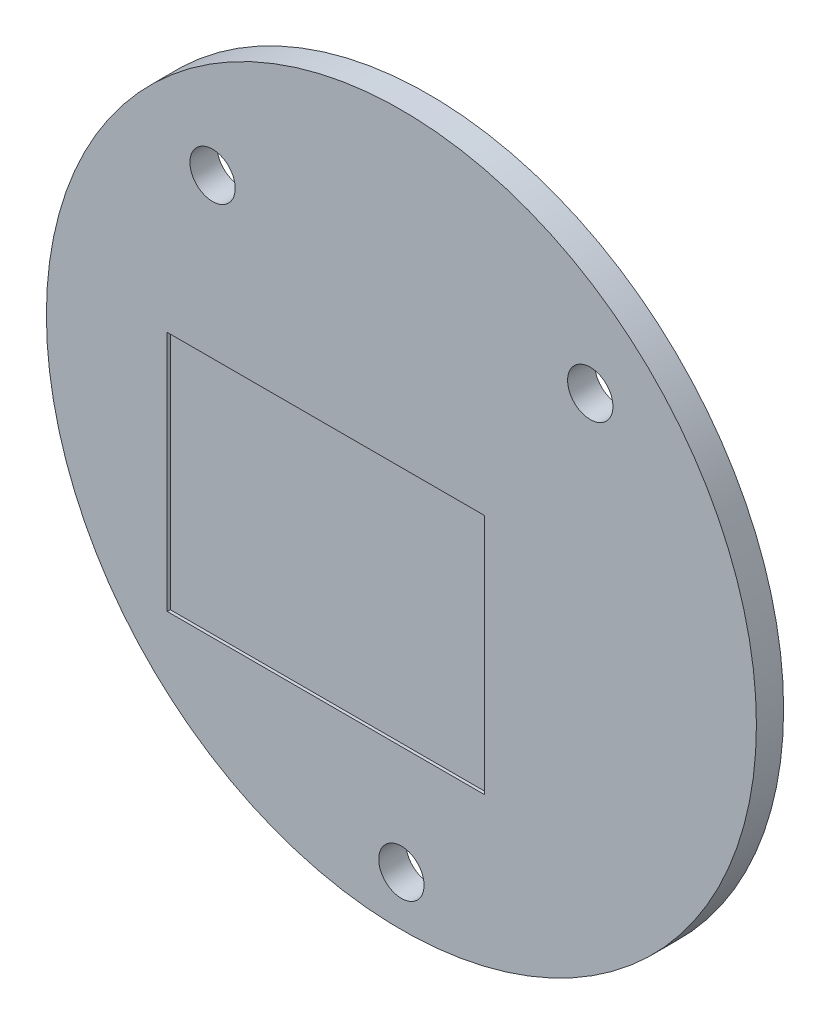
ISO-10303-21;
HEADER;
FILE_DESCRIPTION(('STEP AP214'),'2;1');
FILE_NAME('part.step','',(''),(''),'','','');
FILE_SCHEMA(('AUTOMOTIVE_DESIGN { 1 0 10303 214 1 1 1 1 }'));
ENDSEC;
DATA;
#1=APPLICATION_CONTEXT('core data for automotive mechanical design processes');
#2=APPLICATION_PROTOCOL_DEFINITION('international standard','automotive_design',2000,#1);
#3=PRODUCT_CONTEXT('',#1,'mechanical');
#4=PRODUCT('Part','Part','',(#3));
#5=PRODUCT_RELATED_PRODUCT_CATEGORY('part','',(#4));
#6=PRODUCT_DEFINITION_FORMATION('','',#4);
#7=PRODUCT_DEFINITION_CONTEXT('part definition',#1,'design');
#8=PRODUCT_DEFINITION('design','',#6,#7);
#9=PRODUCT_DEFINITION_SHAPE('','',#8);
#10=(LENGTH_UNIT() NAMED_UNIT(*) SI_UNIT(.MILLI.,.METRE.));
#11=(NAMED_UNIT(*) PLANE_ANGLE_UNIT() SI_UNIT($,.RADIAN.));
#12=(NAMED_UNIT(*) SI_UNIT($,.STERADIAN.) SOLID_ANGLE_UNIT());
#13=UNCERTAINTY_MEASURE_WITH_UNIT(LENGTH_MEASURE(1.E-05),#10,'distance_accuracy_value','');
#14=(GEOMETRIC_REPRESENTATION_CONTEXT(3) GLOBAL_UNCERTAINTY_ASSIGNED_CONTEXT((#13)) GLOBAL_UNIT_ASSIGNED_CONTEXT((#10,
#11,#12)) REPRESENTATION_CONTEXT('',''));
#15=CARTESIAN_POINT('',(0.,0.,0.));
#16=DIRECTION('',(0.,0.,1.));
#17=DIRECTION('',(1.,0.,0.));
#18=AXIS2_PLACEMENT_3D('',#15,#16,#17);
#19=CARTESIAN_POINT('',(0.,0.,1.8));
#20=DIRECTION('',(0.,0.,1.));
#21=DIRECTION('',(1.,0.,0.));
#22=AXIS2_PLACEMENT_3D('',#19,#20,#21);
#23=PLANE('',#22);
#24=DIRECTION('',(0.,-1.,0.));
#25=VECTOR('',#24,1.);
#26=CARTESIAN_POINT('',(-15.4999999999998,-13.0000000000009,1.8));
#27=LINE('',#26,#25);
#28=CARTESIAN_POINT('',(-15.4999999999999,2.99999999999993,1.8));
#29=VERTEX_POINT('',#28);
#30=CARTESIAN_POINT('',(-15.4999999999998,-13.0000000000009,1.8));
#31=VERTEX_POINT('',#30);
#32=EDGE_CURVE('E47',#29,#31,#27,.T.);
#33=ORIENTED_EDGE('',*,*,#32,.F.);
#34=DIRECTION('',(-1.,0.,0.));
#35=VECTOR('',#34,1.);
#36=CARTESIAN_POINT('',(-15.4999999999999,2.99999999999993,1.8));
#37=LINE('',#36,#35);
#38=CARTESIAN_POINT('',(5.49999999999998,3.00000000000003,1.8));
#39=VERTEX_POINT('',#38);
#40=EDGE_CURVE('E98',#39,#29,#37,.T.);
#41=ORIENTED_EDGE('',*,*,#40,.F.);
#42=DIRECTION('',(0.,1.,0.));
#43=VECTOR('',#42,1.);
#44=CARTESIAN_POINT('',(5.50000000000019,-13.0000000000008,1.8));
#45=LINE('',#44,#43);
#46=CARTESIAN_POINT('',(5.50000000000019,-13.0000000000008,1.8));
#47=VERTEX_POINT('',#46);
#48=EDGE_CURVE('E104',#47,#39,#45,.T.);
#49=ORIENTED_EDGE('',*,*,#48,.F.);
#50=DIRECTION('',(1.,0.,0.));
#51=VECTOR('',#50,1.);
#52=CARTESIAN_POINT('',(-15.4999999999998,-13.0000000000009,1.8));
#53=LINE('',#52,#51);
#54=EDGE_CURVE('E82',#31,#47,#53,.T.);
#55=ORIENTED_EDGE('',*,*,#54,.F.);
#56=EDGE_LOOP('',(#33,#41,#49,#55));
#57=FACE_BOUND('',#56,.T.);
#58=CARTESIAN_POINT('',(-12.5,13.5,1.8));
#59=DIRECTION('',(0.,0.,1.));
#60=DIRECTION('',(1.,0.,0.));
#61=AXIS2_PLACEMENT_3D('',#58,#59,#60);
#62=CIRCLE('',#61,1.5);
#63=CARTESIAN_POINT('',(-11.,13.5,1.8));
#64=VERTEX_POINT('',#63);
#65=EDGE_CURVE('E117',#64,#64,#62,.T.);
#66=ORIENTED_EDGE('',*,*,#65,.F.);
#67=EDGE_LOOP('',(#66));
#68=FACE_BOUND('',#67,.T.);
#69=CARTESIAN_POINT('',(0.,0.,1.8));
#70=DIRECTION('',(0.,0.,1.));
#71=DIRECTION('',(1.,0.,0.));
#72=AXIS2_PLACEMENT_3D('',#69,#70,#71);
#73=CIRCLE('',#72,23.5);
#74=CARTESIAN_POINT('',(23.5,0.,1.8));
#75=VERTEX_POINT('',#74);
#76=EDGE_CURVE('E11',#75,#75,#73,.T.);
#77=ORIENTED_EDGE('',*,*,#76,.T.);
#78=EDGE_LOOP('',(#77));
#79=FACE_BOUND('',#78,.T.);
#80=CARTESIAN_POINT('',(0.,-20.2,1.8));
#81=DIRECTION('',(0.,0.,1.));
#82=DIRECTION('',(1.,0.,0.));
#83=AXIS2_PLACEMENT_3D('',#80,#81,#82);
#84=CIRCLE('',#83,1.5);
#85=CARTESIAN_POINT('',(1.5,-20.2,1.8));
#86=VERTEX_POINT('',#85);
#87=EDGE_CURVE('E123',#86,#86,#84,.T.);
#88=ORIENTED_EDGE('',*,*,#87,.F.);
#89=EDGE_LOOP('',(#88));
#90=FACE_BOUND('',#89,.T.);
#91=CARTESIAN_POINT('',(12.5,13.5,1.8));
#92=DIRECTION('',(0.,0.,1.));
#93=DIRECTION('',(1.,0.,0.));
#94=AXIS2_PLACEMENT_3D('',#91,#92,#93);
#95=CIRCLE('',#94,1.5);
#96=CARTESIAN_POINT('',(14.,13.5,1.8));
#97=VERTEX_POINT('',#96);
#98=EDGE_CURVE('E111',#97,#97,#95,.T.);
#99=ORIENTED_EDGE('',*,*,#98,.F.);
#100=EDGE_LOOP('',(#99));
#101=FACE_BOUND('',#100,.T.);
#102=ADVANCED_FACE('F32',(#57,#68,#79,#90,#101),#23,.T.);
#103=CARTESIAN_POINT('',(0.,0.,0.));
#104=DIRECTION('',(0.,0.,1.));
#105=DIRECTION('',(1.,0.,0.));
#106=AXIS2_PLACEMENT_3D('',#103,#104,#105);
#107=PLANE('',#106);
#108=CARTESIAN_POINT('',(0.,0.,0.));
#109=DIRECTION('',(0.,0.,1.));
#110=DIRECTION('',(1.,0.,0.));
#111=AXIS2_PLACEMENT_3D('',#108,#109,#110);
#112=CIRCLE('',#111,23.5);
#113=CARTESIAN_POINT('',(23.5,0.,0.));
#114=VERTEX_POINT('',#113);
#115=EDGE_CURVE('E36',#114,#114,#112,.T.);
#116=ORIENTED_EDGE('',*,*,#115,.F.);
#117=EDGE_LOOP('',(#116));
#118=FACE_BOUND('',#117,.T.);
#119=CARTESIAN_POINT('',(0.,-20.2,0.));
#120=DIRECTION('',(0.,0.,1.));
#121=DIRECTION('',(1.,0.,0.));
#122=AXIS2_PLACEMENT_3D('',#119,#120,#121);
#123=CIRCLE('',#122,1.5);
#124=CARTESIAN_POINT('',(1.5,-20.2,0.));
#125=VERTEX_POINT('',#124);
#126=EDGE_CURVE('E120',#125,#125,#123,.T.);
#127=ORIENTED_EDGE('',*,*,#126,.T.);
#128=EDGE_LOOP('',(#127));
#129=FACE_BOUND('',#128,.T.);
#130=CARTESIAN_POINT('',(-12.5,13.5,0.));
#131=DIRECTION('',(0.,0.,1.));
#132=DIRECTION('',(1.,0.,0.));
#133=AXIS2_PLACEMENT_3D('',#130,#131,#132);
#134=CIRCLE('',#133,1.5);
#135=CARTESIAN_POINT('',(-11.,13.5,0.));
#136=VERTEX_POINT('',#135);
#137=EDGE_CURVE('E114',#136,#136,#134,.T.);
#138=ORIENTED_EDGE('',*,*,#137,.T.);
#139=EDGE_LOOP('',(#138));
#140=FACE_BOUND('',#139,.T.);
#141=CARTESIAN_POINT('',(12.5,13.5,0.));
#142=DIRECTION('',(0.,0.,1.));
#143=DIRECTION('',(1.,0.,0.));
#144=AXIS2_PLACEMENT_3D('',#141,#142,#143);
#145=CIRCLE('',#144,1.5);
#146=CARTESIAN_POINT('',(14.,13.5,0.));
#147=VERTEX_POINT('',#146);
#148=EDGE_CURVE('E108',#147,#147,#145,.T.);
#149=ORIENTED_EDGE('',*,*,#148,.T.);
#150=EDGE_LOOP('',(#149));
#151=FACE_BOUND('',#150,.T.);
#152=ADVANCED_FACE('F129',(#118,#129,#140,#151),#107,.F.);
#153=CARTESIAN_POINT('',(0.,0.,1.8));
#154=DIRECTION('',(0.,0.,-1.));
#155=DIRECTION('',(-1.,0.,0.));
#156=AXIS2_PLACEMENT_3D('',#153,#154,#155);
#157=CYLINDRICAL_SURFACE('',#156,23.5);
#158=ORIENTED_EDGE('',*,*,#76,.F.);
#159=EDGE_LOOP('',(#158));
#160=FACE_BOUND('',#159,.T.);
#161=ORIENTED_EDGE('',*,*,#115,.T.);
#162=EDGE_LOOP('',(#161));
#163=FACE_BOUND('',#162,.T.);
#164=ADVANCED_FACE('F34',(#160,#163),#157,.T.);
#165=CARTESIAN_POINT('',(0.,-20.2,1.8));
#166=DIRECTION('',(0.,0.,-1.));
#167=DIRECTION('',(-1.,0.,0.));
#168=AXIS2_PLACEMENT_3D('',#165,#166,#167);
#169=CYLINDRICAL_SURFACE('',#168,1.5);
#170=ORIENTED_EDGE('',*,*,#87,.T.);
#171=EDGE_LOOP('',(#170));
#172=FACE_BOUND('',#171,.T.);
#173=ORIENTED_EDGE('',*,*,#126,.F.);
#174=EDGE_LOOP('',(#173));
#175=FACE_BOUND('',#174,.T.);
#176=ADVANCED_FACE('F132',(#172,#175),#169,.F.);
#177=CARTESIAN_POINT('',(-12.5,13.5,1.8));
#178=DIRECTION('',(0.,0.,-1.));
#179=DIRECTION('',(-1.,0.,0.));
#180=AXIS2_PLACEMENT_3D('',#177,#178,#179);
#181=CYLINDRICAL_SURFACE('',#180,1.5);
#182=ORIENTED_EDGE('',*,*,#65,.T.);
#183=EDGE_LOOP('',(#182));
#184=FACE_BOUND('',#183,.T.);
#185=ORIENTED_EDGE('',*,*,#137,.F.);
#186=EDGE_LOOP('',(#185));
#187=FACE_BOUND('',#186,.T.);
#188=ADVANCED_FACE('F134',(#184,#187),#181,.F.);
#189=CARTESIAN_POINT('',(12.5,13.5,1.8));
#190=DIRECTION('',(0.,0.,-1.));
#191=DIRECTION('',(-1.,0.,0.));
#192=AXIS2_PLACEMENT_3D('',#189,#190,#191);
#193=CYLINDRICAL_SURFACE('',#192,1.5);
#194=ORIENTED_EDGE('',*,*,#98,.T.);
#195=EDGE_LOOP('',(#194));
#196=FACE_BOUND('',#195,.T.);
#197=ORIENTED_EDGE('',*,*,#148,.F.);
#198=EDGE_LOOP('',(#197));
#199=FACE_BOUND('',#198,.T.);
#200=ADVANCED_FACE('F141',(#196,#199),#193,.F.);
#201=CARTESIAN_POINT('',(-15.4999999999998,-13.0000000000009,1.6));
#202=DIRECTION('',(-1.,0.,0.));
#203=DIRECTION('',(0.,-1.,0.));
#204=AXIS2_PLACEMENT_3D('',#201,#202,#203);
#205=PLANE('',#204);
#206=ORIENTED_EDGE('',*,*,#32,.T.);
#207=DIRECTION('',(0.,0.,1.));
#208=VECTOR('',#207,1.);
#209=CARTESIAN_POINT('',(-15.4999999999998,-13.0000000000009,1.6));
#210=LINE('',#209,#208);
#211=CARTESIAN_POINT('',(-15.4999999999998,-13.0000000000009,1.6));
#212=VERTEX_POINT('',#211);
#213=EDGE_CURVE('E70',#212,#31,#210,.T.);
#214=ORIENTED_EDGE('',*,*,#213,.F.);
#215=DIRECTION('',(0.,-1.,0.));
#216=VECTOR('',#215,1.);
#217=CARTESIAN_POINT('',(-15.4999999999998,-13.0000000000009,1.6));
#218=LINE('',#217,#216);
#219=CARTESIAN_POINT('',(-15.4999999999999,2.99999999999993,1.6));
#220=VERTEX_POINT('',#219);
#221=EDGE_CURVE('E96',#220,#212,#218,.T.);
#222=ORIENTED_EDGE('',*,*,#221,.F.);
#223=DIRECTION('',(0.,0.,1.));
#224=VECTOR('',#223,1.);
#225=CARTESIAN_POINT('',(-15.4999999999999,2.99999999999993,1.6));
#226=LINE('',#225,#224);
#227=EDGE_CURVE('E55',#220,#29,#226,.T.);
#228=ORIENTED_EDGE('',*,*,#227,.T.);
#229=EDGE_LOOP('',(#206,#214,#222,#228));
#230=FACE_BOUND('',#229,.T.);
#231=ADVANCED_FACE('F164',(#230),#205,.F.);
#232=CARTESIAN_POINT('',(-15.4999999999999,2.99999999999993,1.6));
#233=DIRECTION('',(0.,1.,0.));
#234=DIRECTION('',(-1.,0.,0.));
#235=AXIS2_PLACEMENT_3D('',#232,#233,#234);
#236=PLANE('',#235);
#237=ORIENTED_EDGE('',*,*,#40,.T.);
#238=ORIENTED_EDGE('',*,*,#227,.F.);
#239=DIRECTION('',(-1.,0.,0.));
#240=VECTOR('',#239,1.);
#241=CARTESIAN_POINT('',(-15.4999999999999,2.99999999999993,1.6));
#242=LINE('',#241,#240);
#243=CARTESIAN_POINT('',(5.49999999999998,3.00000000000003,1.6));
#244=VERTEX_POINT('',#243);
#245=EDGE_CURVE('E93',#244,#220,#242,.T.);
#246=ORIENTED_EDGE('',*,*,#245,.F.);
#247=DIRECTION('',(0.,0.,1.));
#248=VECTOR('',#247,1.);
#249=CARTESIAN_POINT('',(5.49999999999998,3.00000000000003,1.6));
#250=LINE('',#249,#248);
#251=EDGE_CURVE('E86',#244,#39,#250,.T.);
#252=ORIENTED_EDGE('',*,*,#251,.T.);
#253=EDGE_LOOP('',(#237,#238,#246,#252));
#254=FACE_BOUND('',#253,.T.);
#255=ADVANCED_FACE('F171',(#254),#236,.F.);
#256=CARTESIAN_POINT('',(5.50000000000019,-13.0000000000008,1.6));
#257=DIRECTION('',(1.,0.,0.));
#258=DIRECTION('',(0.,1.,0.));
#259=AXIS2_PLACEMENT_3D('',#256,#257,#258);
#260=PLANE('',#259);
#261=ORIENTED_EDGE('',*,*,#48,.T.);
#262=ORIENTED_EDGE('',*,*,#251,.F.);
#263=DIRECTION('',(0.,1.,0.));
#264=VECTOR('',#263,1.);
#265=CARTESIAN_POINT('',(5.50000000000019,-13.0000000000008,1.6));
#266=LINE('',#265,#264);
#267=CARTESIAN_POINT('',(5.50000000000019,-13.0000000000008,1.6));
#268=VERTEX_POINT('',#267);
#269=EDGE_CURVE('E89',#268,#244,#266,.T.);
#270=ORIENTED_EDGE('',*,*,#269,.F.);
#271=DIRECTION('',(0.,0.,1.));
#272=VECTOR('',#271,1.);
#273=CARTESIAN_POINT('',(5.50000000000019,-13.0000000000008,1.6));
#274=LINE('',#273,#272);
#275=EDGE_CURVE('E75',#268,#47,#274,.T.);
#276=ORIENTED_EDGE('',*,*,#275,.T.);
#277=EDGE_LOOP('',(#261,#262,#270,#276));
#278=FACE_BOUND('',#277,.T.);
#279=ADVANCED_FACE('F90',(#278),#260,.F.);
#280=CARTESIAN_POINT('',(-15.4999999999998,-13.0000000000009,1.6));
#281=DIRECTION('',(0.,-1.,0.));
#282=DIRECTION('',(1.,0.,0.));
#283=AXIS2_PLACEMENT_3D('',#280,#281,#282);
#284=PLANE('',#283);
#285=ORIENTED_EDGE('',*,*,#54,.T.);
#286=ORIENTED_EDGE('',*,*,#275,.F.);
#287=DIRECTION('',(1.,0.,0.));
#288=VECTOR('',#287,1.);
#289=CARTESIAN_POINT('',(-15.4999999999998,-13.0000000000009,1.6));
#290=LINE('',#289,#288);
#291=EDGE_CURVE('E79',#212,#268,#290,.T.);
#292=ORIENTED_EDGE('',*,*,#291,.F.);
#293=ORIENTED_EDGE('',*,*,#213,.T.);
#294=EDGE_LOOP('',(#285,#286,#292,#293));
#295=FACE_BOUND('',#294,.T.);
#296=ADVANCED_FACE('F77',(#295),#284,.F.);
#297=CARTESIAN_POINT('',(0.,0.,1.6));
#298=DIRECTION('',(0.,0.,-1.));
#299=DIRECTION('',(-1.,0.,0.));
#300=AXIS2_PLACEMENT_3D('',#297,#298,#299);
#301=PLANE('',#300);
#302=ORIENTED_EDGE('',*,*,#221,.T.);
#303=ORIENTED_EDGE('',*,*,#291,.T.);
#304=ORIENTED_EDGE('',*,*,#269,.T.);
#305=ORIENTED_EDGE('',*,*,#245,.T.);
#306=EDGE_LOOP('',(#302,#303,#304,#305));
#307=FACE_BOUND('',#306,.T.);
#308=ADVANCED_FACE('F95',(#307),#301,.F.);
#309=CLOSED_SHELL('',(#102,#152,#164,#176,#188,#200,#231,#255,#279,#296,#308));
#310=MANIFOLD_SOLID_BREP('B2',#309);
#311=ADVANCED_BREP_SHAPE_REPRESENTATION('',(#18,#310),#14);
#312=SHAPE_DEFINITION_REPRESENTATION(#9,#311);
ENDSEC;
END-ISO-10303-21;
